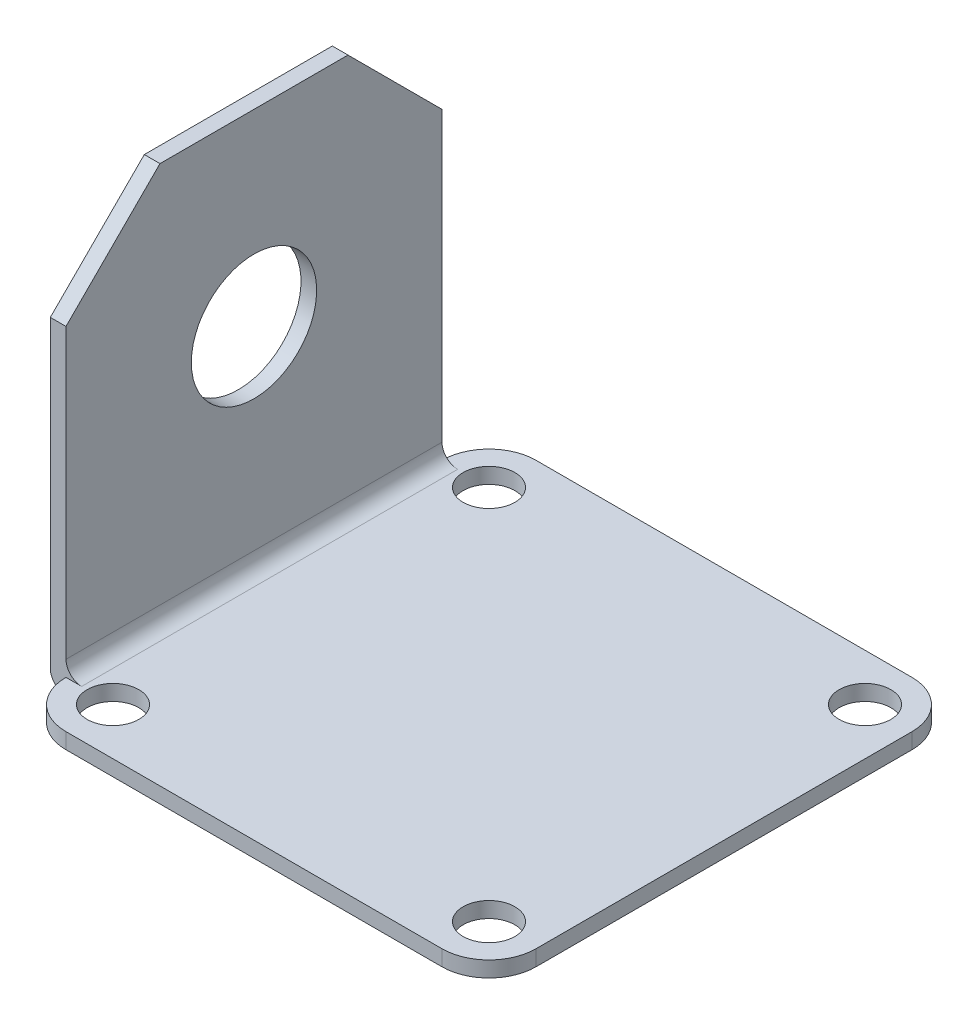
ISO-10303-21;
HEADER;
FILE_DESCRIPTION(('STEP AP214'),'2;1');
FILE_NAME('part.step','',(''),(''),'','','');
FILE_SCHEMA(('AUTOMOTIVE_DESIGN { 1 0 10303 214 1 1 1 1 }'));
ENDSEC;
DATA;
#1=APPLICATION_CONTEXT('core data for automotive mechanical design processes');
#2=APPLICATION_PROTOCOL_DEFINITION('international standard','automotive_design',2000,#1);
#3=PRODUCT_CONTEXT('',#1,'mechanical');
#4=PRODUCT('Part','Part','',(#3));
#5=PRODUCT_RELATED_PRODUCT_CATEGORY('part','',(#4));
#6=PRODUCT_DEFINITION_FORMATION('','',#4);
#7=PRODUCT_DEFINITION_CONTEXT('part definition',#1,'design');
#8=PRODUCT_DEFINITION('design','',#6,#7);
#9=PRODUCT_DEFINITION_SHAPE('','',#8);
#10=(LENGTH_UNIT() NAMED_UNIT(*) SI_UNIT(.MILLI.,.METRE.));
#11=(NAMED_UNIT(*) PLANE_ANGLE_UNIT() SI_UNIT($,.RADIAN.));
#12=(NAMED_UNIT(*) SI_UNIT($,.STERADIAN.) SOLID_ANGLE_UNIT());
#13=UNCERTAINTY_MEASURE_WITH_UNIT(LENGTH_MEASURE(1.E-05),#10,'distance_accuracy_value','');
#14=(GEOMETRIC_REPRESENTATION_CONTEXT(3) GLOBAL_UNCERTAINTY_ASSIGNED_CONTEXT((#13)) GLOBAL_UNIT_ASSIGNED_CONTEXT((#10,
#11,#12)) REPRESENTATION_CONTEXT('',''));
#15=CARTESIAN_POINT('',(0.,0.,0.));
#16=DIRECTION('',(0.,0.,1.));
#17=DIRECTION('',(1.,0.,0.));
#18=AXIS2_PLACEMENT_3D('',#15,#16,#17);
#19=CARTESIAN_POINT('',(3.,26.4,12.));
#20=DIRECTION('',(0.,-1.,0.));
#21=DIRECTION('',(0.,0.,-1.));
#22=AXIS2_PLACEMENT_3D('',#19,#20,#21);
#23=CYLINDRICAL_SURFACE('',#22,3.);
#24=CARTESIAN_POINT('',(3.,1.,12.));
#25=DIRECTION('',(0.,1.,0.));
#26=DIRECTION('',(0.,0.,1.));
#27=AXIS2_PLACEMENT_3D('',#24,#25,#26);
#28=CIRCLE('',#27,3.);
#29=CARTESIAN_POINT('',(0.,1.,12.));
#30=VERTEX_POINT('',#29);
#31=CARTESIAN_POINT('',(3.00000000000002,1.,15.));
#32=VERTEX_POINT('',#31);
#33=EDGE_CURVE('E276',#30,#32,#28,.T.);
#34=ORIENTED_EDGE('',*,*,#33,.F.);
#35=DIRECTION('',(0.,-1.,0.));
#36=VECTOR('',#35,1.);
#37=CARTESIAN_POINT('',(0.,26.4,12.));
#38=LINE('',#37,#36);
#39=CARTESIAN_POINT('',(0.,0.,12.));
#40=VERTEX_POINT('',#39);
#41=EDGE_CURVE('E182',#30,#40,#38,.T.);
#42=ORIENTED_EDGE('',*,*,#41,.T.);
#43=CARTESIAN_POINT('',(3.,0.,12.));
#44=DIRECTION('',(0.,1.,0.));
#45=DIRECTION('',(0.,0.,1.));
#46=AXIS2_PLACEMENT_3D('',#43,#44,#45);
#47=CIRCLE('',#46,3.);
#48=CARTESIAN_POINT('',(3.00000000000002,0.,15.));
#49=VERTEX_POINT('',#48);
#50=EDGE_CURVE('E290',#40,#49,#47,.T.);
#51=ORIENTED_EDGE('',*,*,#50,.T.);
#52=DIRECTION('',(0.,-1.,0.));
#53=VECTOR('',#52,1.);
#54=CARTESIAN_POINT('',(3.00000000000002,26.4,15.));
#55=LINE('',#54,#53);
#56=EDGE_CURVE('E180',#32,#49,#55,.T.);
#57=ORIENTED_EDGE('',*,*,#56,.F.);
#58=EDGE_LOOP('',(#34,#42,#51,#57));
#59=FACE_BOUND('',#58,.T.);
#60=ADVANCED_FACE('F26',(#59),#23,.T.);
#61=CARTESIAN_POINT('',(3.00000000000002,26.4,15.));
#62=DIRECTION('',(0.,0.,-1.));
#63=DIRECTION('',(-1.,0.,0.));
#64=AXIS2_PLACEMENT_3D('',#61,#62,#63);
#65=PLANE('',#64);
#66=DIRECTION('',(1.,0.,0.));
#67=VECTOR('',#66,1.);
#68=CARTESIAN_POINT('',(3.00000000000002,1.,15.));
#69=LINE('',#68,#67);
#70=CARTESIAN_POINT('',(27.,1.,15.));
#71=VERTEX_POINT('',#70);
#72=EDGE_CURVE('E274',#32,#71,#69,.T.);
#73=ORIENTED_EDGE('',*,*,#72,.F.);
#74=ORIENTED_EDGE('',*,*,#56,.T.);
#75=DIRECTION('',(1.,0.,0.));
#76=VECTOR('',#75,1.);
#77=CARTESIAN_POINT('',(3.00000000000002,0.,15.));
#78=LINE('',#77,#76);
#79=CARTESIAN_POINT('',(27.,0.,15.));
#80=VERTEX_POINT('',#79);
#81=EDGE_CURVE('E293',#49,#80,#78,.T.);
#82=ORIENTED_EDGE('',*,*,#81,.T.);
#83=DIRECTION('',(0.,-1.,0.));
#84=VECTOR('',#83,1.);
#85=CARTESIAN_POINT('',(27.,26.4,15.));
#86=LINE('',#85,#84);
#87=EDGE_CURVE('E178',#71,#80,#86,.T.);
#88=ORIENTED_EDGE('',*,*,#87,.F.);
#89=EDGE_LOOP('',(#73,#74,#82,#88));
#90=FACE_BOUND('',#89,.T.);
#91=ADVANCED_FACE('F328',(#90),#65,.F.);
#92=CARTESIAN_POINT('',(27.,26.4,12.));
#93=DIRECTION('',(0.,-1.,0.));
#94=DIRECTION('',(0.,0.,-1.));
#95=AXIS2_PLACEMENT_3D('',#92,#93,#94);
#96=CYLINDRICAL_SURFACE('',#95,3.);
#97=CARTESIAN_POINT('',(27.,1.,12.));
#98=DIRECTION('',(0.,1.,0.));
#99=DIRECTION('',(0.,0.,1.));
#100=AXIS2_PLACEMENT_3D('',#97,#98,#99);
#101=CIRCLE('',#100,3.);
#102=CARTESIAN_POINT('',(30.,1.,12.));
#103=VERTEX_POINT('',#102);
#104=EDGE_CURVE('E272',#71,#103,#101,.T.);
#105=ORIENTED_EDGE('',*,*,#104,.F.);
#106=ORIENTED_EDGE('',*,*,#87,.T.);
#107=CARTESIAN_POINT('',(27.,0.,12.));
#108=DIRECTION('',(0.,1.,0.));
#109=DIRECTION('',(0.,0.,1.));
#110=AXIS2_PLACEMENT_3D('',#107,#108,#109);
#111=CIRCLE('',#110,3.);
#112=CARTESIAN_POINT('',(30.,0.,12.));
#113=VERTEX_POINT('',#112);
#114=EDGE_CURVE('E296',#80,#113,#111,.T.);
#115=ORIENTED_EDGE('',*,*,#114,.T.);
#116=DIRECTION('',(0.,-1.,0.));
#117=VECTOR('',#116,1.);
#118=CARTESIAN_POINT('',(30.,26.4,12.));
#119=LINE('',#118,#117);
#120=EDGE_CURVE('E176',#103,#113,#119,.T.);
#121=ORIENTED_EDGE('',*,*,#120,.F.);
#122=EDGE_LOOP('',(#105,#106,#115,#121));
#123=FACE_BOUND('',#122,.T.);
#124=ADVANCED_FACE('F323',(#123),#96,.T.);
#125=CARTESIAN_POINT('',(30.,26.4,12.));
#126=DIRECTION('',(-1.,0.,0.));
#127=DIRECTION('',(0.,0.,1.));
#128=AXIS2_PLACEMENT_3D('',#125,#126,#127);
#129=PLANE('',#128);
#130=DIRECTION('',(0.,0.,-1.));
#131=VECTOR('',#130,1.);
#132=CARTESIAN_POINT('',(30.,1.,12.));
#133=LINE('',#132,#131);
#134=CARTESIAN_POINT('',(30.,1.,-12.));
#135=VERTEX_POINT('',#134);
#136=EDGE_CURVE('E270',#103,#135,#133,.T.);
#137=ORIENTED_EDGE('',*,*,#136,.F.);
#138=ORIENTED_EDGE('',*,*,#120,.T.);
#139=DIRECTION('',(0.,0.,-1.));
#140=VECTOR('',#139,1.);
#141=CARTESIAN_POINT('',(30.,0.,12.));
#142=LINE('',#141,#140);
#143=CARTESIAN_POINT('',(30.,0.,-12.));
#144=VERTEX_POINT('',#143);
#145=EDGE_CURVE('E299',#113,#144,#142,.T.);
#146=ORIENTED_EDGE('',*,*,#145,.T.);
#147=DIRECTION('',(0.,-1.,0.));
#148=VECTOR('',#147,1.);
#149=CARTESIAN_POINT('',(30.,26.4,-12.));
#150=LINE('',#149,#148);
#151=EDGE_CURVE('E174',#135,#144,#150,.T.);
#152=ORIENTED_EDGE('',*,*,#151,.F.);
#153=EDGE_LOOP('',(#137,#138,#146,#152));
#154=FACE_BOUND('',#153,.T.);
#155=ADVANCED_FACE('F319',(#154),#129,.F.);
#156=CARTESIAN_POINT('',(27.,26.4,-12.));
#157=DIRECTION('',(0.,-1.,0.));
#158=DIRECTION('',(0.,0.,-1.));
#159=AXIS2_PLACEMENT_3D('',#156,#157,#158);
#160=CYLINDRICAL_SURFACE('',#159,3.);
#161=CARTESIAN_POINT('',(27.,1.,-12.));
#162=DIRECTION('',(0.,1.,0.));
#163=DIRECTION('',(0.,0.,1.));
#164=AXIS2_PLACEMENT_3D('',#161,#162,#163);
#165=CIRCLE('',#164,3.);
#166=CARTESIAN_POINT('',(27.,1.,-15.));
#167=VERTEX_POINT('',#166);
#168=EDGE_CURVE('E268',#135,#167,#165,.T.);
#169=ORIENTED_EDGE('',*,*,#168,.F.);
#170=ORIENTED_EDGE('',*,*,#151,.T.);
#171=CARTESIAN_POINT('',(27.,0.,-12.));
#172=DIRECTION('',(0.,1.,0.));
#173=DIRECTION('',(0.,0.,1.));
#174=AXIS2_PLACEMENT_3D('',#171,#172,#173);
#175=CIRCLE('',#174,3.);
#176=CARTESIAN_POINT('',(27.,0.,-15.));
#177=VERTEX_POINT('',#176);
#178=EDGE_CURVE('E302',#144,#177,#175,.T.);
#179=ORIENTED_EDGE('',*,*,#178,.T.);
#180=DIRECTION('',(0.,-1.,0.));
#181=VECTOR('',#180,1.);
#182=CARTESIAN_POINT('',(27.,26.4,-15.));
#183=LINE('',#182,#181);
#184=EDGE_CURVE('E172',#167,#177,#183,.T.);
#185=ORIENTED_EDGE('',*,*,#184,.F.);
#186=EDGE_LOOP('',(#169,#170,#179,#185));
#187=FACE_BOUND('',#186,.T.);
#188=ADVANCED_FACE('F315',(#187),#160,.T.);
#189=CARTESIAN_POINT('',(27.,26.4,-15.));
#190=DIRECTION('',(0.,0.,1.));
#191=DIRECTION('',(1.,0.,0.));
#192=AXIS2_PLACEMENT_3D('',#189,#190,#191);
#193=PLANE('',#192);
#194=DIRECTION('',(-1.,0.,0.));
#195=VECTOR('',#194,1.);
#196=CARTESIAN_POINT('',(27.,1.,-15.));
#197=LINE('',#196,#195);
#198=CARTESIAN_POINT('',(3.00000000000002,1.,-15.));
#199=VERTEX_POINT('',#198);
#200=EDGE_CURVE('E235',#167,#199,#197,.T.);
#201=ORIENTED_EDGE('',*,*,#200,.F.);
#202=ORIENTED_EDGE('',*,*,#184,.T.);
#203=DIRECTION('',(-1.,0.,0.));
#204=VECTOR('',#203,1.);
#205=CARTESIAN_POINT('',(27.,0.,-15.));
#206=LINE('',#205,#204);
#207=CARTESIAN_POINT('',(3.00000000000002,0.,-15.));
#208=VERTEX_POINT('',#207);
#209=EDGE_CURVE('E163',#177,#208,#206,.T.);
#210=ORIENTED_EDGE('',*,*,#209,.T.);
#211=DIRECTION('',(0.,-1.,0.));
#212=VECTOR('',#211,1.);
#213=CARTESIAN_POINT('',(3.00000000000002,26.4,-15.));
#214=LINE('',#213,#212);
#215=EDGE_CURVE('E170',#199,#208,#214,.T.);
#216=ORIENTED_EDGE('',*,*,#215,.F.);
#217=EDGE_LOOP('',(#201,#202,#210,#216));
#218=FACE_BOUND('',#217,.T.);
#219=ADVANCED_FACE('F305',(#218),#193,.F.);
#220=CARTESIAN_POINT('',(3.,26.4,-12.));
#221=DIRECTION('',(0.,-1.,0.));
#222=DIRECTION('',(0.,0.,-1.));
#223=AXIS2_PLACEMENT_3D('',#220,#221,#222);
#224=CYLINDRICAL_SURFACE('',#223,3.);
#225=CARTESIAN_POINT('',(3.,1.,-12.));
#226=DIRECTION('',(0.,1.,0.));
#227=DIRECTION('',(0.,0.,1.));
#228=AXIS2_PLACEMENT_3D('',#225,#226,#227);
#229=CIRCLE('',#228,3.);
#230=CARTESIAN_POINT('',(0.,1.,-12.));
#231=VERTEX_POINT('',#230);
#232=EDGE_CURVE('E232',#199,#231,#229,.T.);
#233=ORIENTED_EDGE('',*,*,#232,.F.);
#234=ORIENTED_EDGE('',*,*,#215,.T.);
#235=CARTESIAN_POINT('',(3.,0.,-12.));
#236=DIRECTION('',(0.,1.,0.));
#237=DIRECTION('',(0.,0.,1.));
#238=AXIS2_PLACEMENT_3D('',#235,#236,#237);
#239=CIRCLE('',#238,3.);
#240=CARTESIAN_POINT('',(0.,0.,-12.));
#241=VERTEX_POINT('',#240);
#242=EDGE_CURVE('E158',#208,#241,#239,.T.);
#243=ORIENTED_EDGE('',*,*,#242,.T.);
#244=DIRECTION('',(0.,-1.,0.));
#245=VECTOR('',#244,1.);
#246=CARTESIAN_POINT('',(0.,26.4,-12.));
#247=LINE('',#246,#245);
#248=EDGE_CURVE('E160',#231,#241,#247,.T.);
#249=ORIENTED_EDGE('',*,*,#248,.F.);
#250=EDGE_LOOP('',(#233,#234,#243,#249));
#251=FACE_BOUND('',#250,.T.);
#252=ADVANCED_FACE('F240',(#251),#224,.T.);
#253=CARTESIAN_POINT('',(27.,26.4,12.));
#254=DIRECTION('',(0.,-1.,0.));
#255=DIRECTION('',(0.,0.,-1.));
#256=AXIS2_PLACEMENT_3D('',#253,#254,#255);
#257=CYLINDRICAL_SURFACE('',#256,1.65);
#258=CARTESIAN_POINT('',(27.,0.,12.));
#259=DIRECTION('',(0.,1.,0.));
#260=DIRECTION('',(0.,0.,1.));
#261=AXIS2_PLACEMENT_3D('',#258,#259,#260);
#262=CIRCLE('',#261,1.65);
#263=CARTESIAN_POINT('',(27.,0.,13.65));
#264=VERTEX_POINT('',#263);
#265=EDGE_CURVE('E287',#264,#264,#262,.T.);
#266=ORIENTED_EDGE('',*,*,#265,.F.);
#267=EDGE_LOOP('',(#266));
#268=FACE_BOUND('',#267,.T.);
#269=CARTESIAN_POINT('',(27.,1.,12.));
#270=DIRECTION('',(0.,1.,0.));
#271=DIRECTION('',(0.,0.,1.));
#272=AXIS2_PLACEMENT_3D('',#269,#270,#271);
#273=CIRCLE('',#272,1.65);
#274=CARTESIAN_POINT('',(27.,1.,13.65));
#275=VERTEX_POINT('',#274);
#276=EDGE_CURVE('E238',#275,#275,#273,.T.);
#277=ORIENTED_EDGE('',*,*,#276,.T.);
#278=EDGE_LOOP('',(#277));
#279=FACE_BOUND('',#278,.T.);
#280=ADVANCED_FACE('F381',(#268,#279),#257,.F.);
#281=CARTESIAN_POINT('',(3.00000000000001,26.4,12.));
#282=DIRECTION('',(0.,-1.,0.));
#283=DIRECTION('',(0.,0.,-1.));
#284=AXIS2_PLACEMENT_3D('',#281,#282,#283);
#285=CYLINDRICAL_SURFACE('',#284,1.65);
#286=CARTESIAN_POINT('',(3.00000000000001,0.,12.));
#287=DIRECTION('',(0.,1.,0.));
#288=DIRECTION('',(0.,0.,-1.));
#289=AXIS2_PLACEMENT_3D('',#286,#287,#288);
#290=CIRCLE('',#289,1.65);
#291=CARTESIAN_POINT('',(3.00000000000001,0.,10.35));
#292=VERTEX_POINT('',#291);
#293=EDGE_CURVE('E284',#292,#292,#290,.T.);
#294=ORIENTED_EDGE('',*,*,#293,.F.);
#295=EDGE_LOOP('',(#294));
#296=FACE_BOUND('',#295,.T.);
#297=CARTESIAN_POINT('',(3.00000000000001,1.,12.));
#298=DIRECTION('',(0.,1.,0.));
#299=DIRECTION('',(0.,0.,1.));
#300=AXIS2_PLACEMENT_3D('',#297,#298,#299);
#301=CIRCLE('',#300,1.65);
#302=CARTESIAN_POINT('',(3.00000000000001,1.,13.65));
#303=VERTEX_POINT('',#302);
#304=EDGE_CURVE('E262',#303,#303,#301,.T.);
#305=ORIENTED_EDGE('',*,*,#304,.T.);
#306=EDGE_LOOP('',(#305));
#307=FACE_BOUND('',#306,.T.);
#308=ADVANCED_FACE('F377',(#296,#307),#285,.F.);
#309=CARTESIAN_POINT('',(3.00000000000001,26.4,-12.));
#310=DIRECTION('',(0.,-1.,0.));
#311=DIRECTION('',(0.,0.,-1.));
#312=AXIS2_PLACEMENT_3D('',#309,#310,#311);
#313=CYLINDRICAL_SURFACE('',#312,1.65);
#314=CARTESIAN_POINT('',(3.00000000000001,0.,-12.));
#315=DIRECTION('',(0.,1.,0.));
#316=DIRECTION('',(0.,0.,1.));
#317=AXIS2_PLACEMENT_3D('',#314,#315,#316);
#318=CIRCLE('',#317,1.65);
#319=CARTESIAN_POINT('',(3.00000000000001,0.,-10.35));
#320=VERTEX_POINT('',#319);
#321=EDGE_CURVE('E281',#320,#320,#318,.T.);
#322=ORIENTED_EDGE('',*,*,#321,.F.);
#323=EDGE_LOOP('',(#322));
#324=FACE_BOUND('',#323,.T.);
#325=CARTESIAN_POINT('',(3.00000000000001,1.,-12.));
#326=DIRECTION('',(0.,1.,0.));
#327=DIRECTION('',(0.,0.,1.));
#328=AXIS2_PLACEMENT_3D('',#325,#326,#327);
#329=CIRCLE('',#328,1.65);
#330=CARTESIAN_POINT('',(3.00000000000001,1.,-10.35));
#331=VERTEX_POINT('',#330);
#332=EDGE_CURVE('E191',#331,#331,#329,.T.);
#333=ORIENTED_EDGE('',*,*,#332,.T.);
#334=EDGE_LOOP('',(#333));
#335=FACE_BOUND('',#334,.T.);
#336=ADVANCED_FACE('F373',(#324,#335),#313,.F.);
#337=CARTESIAN_POINT('',(27.,26.4,-12.));
#338=DIRECTION('',(0.,-1.,0.));
#339=DIRECTION('',(0.,0.,-1.));
#340=AXIS2_PLACEMENT_3D('',#337,#338,#339);
#341=CYLINDRICAL_SURFACE('',#340,1.65);
#342=CARTESIAN_POINT('',(27.,0.,-12.));
#343=DIRECTION('',(0.,1.,0.));
#344=DIRECTION('',(0.,0.,-1.));
#345=AXIS2_PLACEMENT_3D('',#342,#343,#344);
#346=CIRCLE('',#345,1.65);
#347=CARTESIAN_POINT('',(27.,0.,-13.65));
#348=VERTEX_POINT('',#347);
#349=EDGE_CURVE('E278',#348,#348,#346,.T.);
#350=ORIENTED_EDGE('',*,*,#349,.F.);
#351=EDGE_LOOP('',(#350));
#352=FACE_BOUND('',#351,.T.);
#353=CARTESIAN_POINT('',(27.,1.,-12.));
#354=DIRECTION('',(0.,1.,0.));
#355=DIRECTION('',(0.,0.,1.));
#356=AXIS2_PLACEMENT_3D('',#353,#354,#355);
#357=CIRCLE('',#356,1.65);
#358=CARTESIAN_POINT('',(27.,1.,-10.35));
#359=VERTEX_POINT('',#358);
#360=EDGE_CURVE('E188',#359,#359,#357,.T.);
#361=ORIENTED_EDGE('',*,*,#360,.T.);
#362=EDGE_LOOP('',(#361));
#363=FACE_BOUND('',#362,.T.);
#364=ADVANCED_FACE('F370',(#352,#363),#341,.F.);
#365=CARTESIAN_POINT('',(3.,26.4,12.));
#366=DIRECTION('',(0.,1.,0.));
#367=DIRECTION('',(0.,0.,1.));
#368=AXIS2_PLACEMENT_3D('',#365,#366,#367);
#369=PLANE('',#368);
#370=DIRECTION('',(-1.,0.,0.));
#371=VECTOR('',#370,1.);
#372=CARTESIAN_POINT('',(1.00000000000001,26.4,6.));
#373=LINE('',#372,#371);
#374=CARTESIAN_POINT('',(0.,26.4,6.));
#375=VERTEX_POINT('',#374);
#376=CARTESIAN_POINT('',(-0.999999999999994,26.4,6.));
#377=VERTEX_POINT('',#376);
#378=EDGE_CURVE('E132',#375,#377,#373,.T.);
#379=ORIENTED_EDGE('',*,*,#378,.F.);
#380=DIRECTION('',(0.,0.,1.));
#381=VECTOR('',#380,1.);
#382=CARTESIAN_POINT('',(0.,26.4,-16.5358170068647));
#383=LINE('',#382,#381);
#384=CARTESIAN_POINT('',(0.,26.4,-6.));
#385=VERTEX_POINT('',#384);
#386=EDGE_CURVE('E192',#385,#375,#383,.T.);
#387=ORIENTED_EDGE('',*,*,#386,.F.);
#388=DIRECTION('',(-1.,0.,0.));
#389=VECTOR('',#388,1.);
#390=CARTESIAN_POINT('',(1.00000000000001,26.4,-6.));
#391=LINE('',#390,#389);
#392=CARTESIAN_POINT('',(-0.999999999999994,26.4,-6.));
#393=VERTEX_POINT('',#392);
#394=EDGE_CURVE('E156',#385,#393,#391,.T.);
#395=ORIENTED_EDGE('',*,*,#394,.T.);
#396=DIRECTION('',(0.,0.,1.));
#397=VECTOR('',#396,1.);
#398=CARTESIAN_POINT('',(-0.999999999999995,26.4,-12.));
#399=LINE('',#398,#397);
#400=EDGE_CURVE('E149',#393,#377,#399,.T.);
#401=ORIENTED_EDGE('',*,*,#400,.T.);
#402=EDGE_LOOP('',(#379,#387,#395,#401));
#403=FACE_BOUND('',#402,.T.);
#404=ADVANCED_FACE('F155',(#403),#369,.T.);
#405=CARTESIAN_POINT('',(3.,0.,12.));
#406=DIRECTION('',(0.,1.,0.));
#407=DIRECTION('',(0.,0.,1.));
#408=AXIS2_PLACEMENT_3D('',#405,#406,#407);
#409=PLANE('',#408);
#410=ORIENTED_EDGE('',*,*,#321,.T.);
#411=EDGE_LOOP('',(#410));
#412=FACE_BOUND('',#411,.T.);
#413=ORIENTED_EDGE('',*,*,#265,.T.);
#414=EDGE_LOOP('',(#413));
#415=FACE_BOUND('',#414,.T.);
#416=ORIENTED_EDGE('',*,*,#50,.F.);
#417=DIRECTION('',(0.,0.,1.));
#418=VECTOR('',#417,1.);
#419=CARTESIAN_POINT('',(0.,0.,12.));
#420=LINE('',#419,#418);
#421=EDGE_CURVE('E212',#40,#241,#420,.F.);
#422=ORIENTED_EDGE('',*,*,#421,.T.);
#423=ORIENTED_EDGE('',*,*,#242,.F.);
#424=ORIENTED_EDGE('',*,*,#209,.F.);
#425=ORIENTED_EDGE('',*,*,#178,.F.);
#426=ORIENTED_EDGE('',*,*,#145,.F.);
#427=ORIENTED_EDGE('',*,*,#114,.F.);
#428=ORIENTED_EDGE('',*,*,#81,.F.);
#429=EDGE_LOOP('',(#416,#422,#423,#424,#425,#426,#427,#428));
#430=FACE_BOUND('',#429,.T.);
#431=ORIENTED_EDGE('',*,*,#293,.T.);
#432=EDGE_LOOP('',(#431));
#433=FACE_BOUND('',#432,.T.);
#434=ORIENTED_EDGE('',*,*,#349,.T.);
#435=EDGE_LOOP('',(#434));
#436=FACE_BOUND('',#435,.T.);
#437=ADVANCED_FACE('F309',(#412,#415,#430,#433,#436),#409,.F.);
#438=CARTESIAN_POINT('',(-0.999999999999995,26.4,-12.));
#439=DIRECTION('',(1.,0.,0.));
#440=DIRECTION('',(0.,0.,-1.));
#441=AXIS2_PLACEMENT_3D('',#438,#439,#440);
#442=PLANE('',#441);
#443=CARTESIAN_POINT('',(-0.999999999999994,14.4,0.));
#444=DIRECTION('',(-1.,0.,0.));
#445=DIRECTION('',(0.,0.,1.));
#446=AXIS2_PLACEMENT_3D('',#443,#444,#445);
#447=CIRCLE('',#446,4.);
#448=CARTESIAN_POINT('',(-0.999999999999994,14.4,4.));
#449=VERTEX_POINT('',#448);
#450=EDGE_CURVE('E196',#449,#449,#447,.T.);
#451=ORIENTED_EDGE('',*,*,#450,.F.);
#452=EDGE_LOOP('',(#451));
#453=FACE_BOUND('',#452,.T.);
#454=DIRECTION('',(0.,-1.,0.));
#455=VECTOR('',#454,1.);
#456=CARTESIAN_POINT('',(-0.999999999999995,26.4,-12.));
#457=LINE('',#456,#455);
#458=CARTESIAN_POINT('',(-0.999999999999995,20.4,-12.));
#459=VERTEX_POINT('',#458);
#460=CARTESIAN_POINT('',(-0.999999999999995,1.,-12.));
#461=VERTEX_POINT('',#460);
#462=EDGE_CURVE('E157',#459,#461,#457,.T.);
#463=ORIENTED_EDGE('',*,*,#462,.T.);
#464=DIRECTION('',(0.,0.,1.));
#465=VECTOR('',#464,1.);
#466=CARTESIAN_POINT('',(-0.999999999999995,1.,-12.));
#467=LINE('',#466,#465);
#468=CARTESIAN_POINT('',(-0.999999999999993,1.,12.));
#469=VERTEX_POINT('',#468);
#470=EDGE_CURVE('E208',#461,#469,#467,.T.);
#471=ORIENTED_EDGE('',*,*,#470,.T.);
#472=DIRECTION('',(0.,-1.,0.));
#473=VECTOR('',#472,1.);
#474=CARTESIAN_POINT('',(-0.999999999999993,26.4,12.));
#475=LINE('',#474,#473);
#476=CARTESIAN_POINT('',(-0.999999999999993,20.4,12.));
#477=VERTEX_POINT('',#476);
#478=EDGE_CURVE('E152',#477,#469,#475,.T.);
#479=ORIENTED_EDGE('',*,*,#478,.F.);
#480=DIRECTION('',(0.,-0.707106781186547,0.707106781186548));
#481=VECTOR('',#480,1.);
#482=CARTESIAN_POINT('',(-0.999999999999993,20.4,12.));
#483=LINE('',#482,#481);
#484=EDGE_CURVE('E135',#377,#477,#483,.T.);
#485=ORIENTED_EDGE('',*,*,#484,.F.);
#486=ORIENTED_EDGE('',*,*,#400,.F.);
#487=DIRECTION('',(0.,0.707106781186547,0.707106781186548));
#488=VECTOR('',#487,1.);
#489=CARTESIAN_POINT('',(-0.999999999999995,20.4,-12.));
#490=LINE('',#489,#488);
#491=EDGE_CURVE('E250',#459,#393,#490,.T.);
#492=ORIENTED_EDGE('',*,*,#491,.F.);
#493=EDGE_LOOP('',(#463,#471,#479,#485,#486,#492));
#494=FACE_BOUND('',#493,.T.);
#495=ADVANCED_FACE('F28',(#453,#494),#442,.F.);
#496=CARTESIAN_POINT('',(-0.999999999999993,26.4,12.));
#497=DIRECTION('',(0.,0.,-1.));
#498=DIRECTION('',(-1.,0.,0.));
#499=AXIS2_PLACEMENT_3D('',#496,#497,#498);
#500=PLANE('',#499);
#501=ORIENTED_EDGE('',*,*,#478,.T.);
#502=CARTESIAN_POINT('',(0.,1.,12.));
#503=DIRECTION('',(0.,0.,-1.));
#504=DIRECTION('',(-1.,0.,0.));
#505=AXIS2_PLACEMENT_3D('',#502,#503,#504);
#506=CIRCLE('',#505,1.);
#507=EDGE_CURVE('E210',#469,#40,#506,.F.);
#508=ORIENTED_EDGE('',*,*,#507,.T.);
#509=ORIENTED_EDGE('',*,*,#41,.F.);
#510=DIRECTION('',(-1.,0.,0.));
#511=VECTOR('',#510,1.);
#512=CARTESIAN_POINT('',(0.,1.,12.));
#513=LINE('',#512,#511);
#514=CARTESIAN_POINT('',(1.,1.,12.));
#515=VERTEX_POINT('',#514);
#516=EDGE_CURVE('E204',#515,#30,#513,.T.);
#517=ORIENTED_EDGE('',*,*,#516,.F.);
#518=CARTESIAN_POINT('',(1.,2.,12.));
#519=DIRECTION('',(0.,0.,-1.));
#520=DIRECTION('',(-1.,0.,0.));
#521=AXIS2_PLACEMENT_3D('',#518,#519,#520);
#522=CIRCLE('',#521,1.);
#523=CARTESIAN_POINT('',(0.,2.,12.));
#524=VERTEX_POINT('',#523);
#525=EDGE_CURVE('E34',#515,#524,#522,.T.);
#526=ORIENTED_EDGE('',*,*,#525,.T.);
#527=CARTESIAN_POINT('',(0.,20.4,12.));
#528=VERTEX_POINT('',#527);
#529=EDGE_CURVE('E183',#528,#524,#38,.T.);
#530=ORIENTED_EDGE('',*,*,#529,.F.);
#531=DIRECTION('',(-1.,0.,0.));
#532=VECTOR('',#531,1.);
#533=CARTESIAN_POINT('',(1.00000000000001,20.4,12.));
#534=LINE('',#533,#532);
#535=EDGE_CURVE('E143',#528,#477,#534,.T.);
#536=ORIENTED_EDGE('',*,*,#535,.T.);
#537=EDGE_LOOP('',(#501,#508,#509,#517,#526,#530,#536));
#538=FACE_BOUND('',#537,.T.);
#539=ADVANCED_FACE('F217',(#538),#500,.F.);
#540=CARTESIAN_POINT('',(0.,26.4,-12.));
#541=DIRECTION('',(0.,0.,1.));
#542=DIRECTION('',(1.,0.,0.));
#543=AXIS2_PLACEMENT_3D('',#540,#541,#542);
#544=PLANE('',#543);
#545=ORIENTED_EDGE('',*,*,#248,.T.);
#546=CARTESIAN_POINT('',(0.,1.,-12.));
#547=DIRECTION('',(0.,0.,1.));
#548=DIRECTION('',(1.,0.,0.));
#549=AXIS2_PLACEMENT_3D('',#546,#547,#548);
#550=CIRCLE('',#549,1.);
#551=EDGE_CURVE('E46',#241,#461,#550,.F.);
#552=ORIENTED_EDGE('',*,*,#551,.T.);
#553=ORIENTED_EDGE('',*,*,#462,.F.);
#554=DIRECTION('',(-1.,0.,0.));
#555=VECTOR('',#554,1.);
#556=CARTESIAN_POINT('',(1.00000000000001,20.4,-12.));
#557=LINE('',#556,#555);
#558=CARTESIAN_POINT('',(0.,20.4,-12.));
#559=VERTEX_POINT('',#558);
#560=EDGE_CURVE('E252',#559,#459,#557,.T.);
#561=ORIENTED_EDGE('',*,*,#560,.F.);
#562=CARTESIAN_POINT('',(0.,2.,-12.));
#563=VERTEX_POINT('',#562);
#564=EDGE_CURVE('E167',#559,#563,#247,.T.);
#565=ORIENTED_EDGE('',*,*,#564,.T.);
#566=CARTESIAN_POINT('',(1.,2.,-11.9999999999999));
#567=DIRECTION('',(0.,0.,1.));
#568=DIRECTION('',(1.,0.,0.));
#569=AXIS2_PLACEMENT_3D('',#566,#567,#568);
#570=CIRCLE('',#569,1.);
#571=CARTESIAN_POINT('',(1.,1.,-11.9999999999999));
#572=VERTEX_POINT('',#571);
#573=EDGE_CURVE('E11',#563,#572,#570,.T.);
#574=ORIENTED_EDGE('',*,*,#573,.T.);
#575=DIRECTION('',(1.,0.,0.));
#576=VECTOR('',#575,1.);
#577=CARTESIAN_POINT('',(8.81550807393855E-13,1.,-12.));
#578=LINE('',#577,#576);
#579=EDGE_CURVE('E40',#231,#572,#578,.T.);
#580=ORIENTED_EDGE('',*,*,#579,.F.);
#581=EDGE_LOOP('',(#545,#552,#553,#561,#565,#574,#580));
#582=FACE_BOUND('',#581,.T.);
#583=ADVANCED_FACE('F227',(#582),#544,.F.);
#584=CARTESIAN_POINT('',(0.,1.,-16.5358170068647));
#585=DIRECTION('',(-1.,0.,0.));
#586=DIRECTION('',(0.,0.,1.));
#587=AXIS2_PLACEMENT_3D('',#584,#585,#586);
#588=PLANE('',#587);
#589=CARTESIAN_POINT('',(0.,14.4,0.));
#590=DIRECTION('',(-1.,0.,0.));
#591=DIRECTION('',(0.,0.,1.));
#592=AXIS2_PLACEMENT_3D('',#589,#590,#591);
#593=CIRCLE('',#592,4.);
#594=CARTESIAN_POINT('',(0.,14.4,4.));
#595=VERTEX_POINT('',#594);
#596=EDGE_CURVE('E193',#595,#595,#593,.T.);
#597=ORIENTED_EDGE('',*,*,#596,.T.);
#598=EDGE_LOOP('',(#597));
#599=FACE_BOUND('',#598,.T.);
#600=ORIENTED_EDGE('',*,*,#529,.T.);
#601=DIRECTION('',(0.,0.,1.));
#602=VECTOR('',#601,1.);
#603=CARTESIAN_POINT('',(0.,2.,-16.5358170068647));
#604=LINE('',#603,#602);
#605=EDGE_CURVE('E206',#524,#563,#604,.F.);
#606=ORIENTED_EDGE('',*,*,#605,.T.);
#607=ORIENTED_EDGE('',*,*,#564,.F.);
#608=DIRECTION('',(0.,0.707106781186547,0.707106781186548));
#609=VECTOR('',#608,1.);
#610=CARTESIAN_POINT('',(0.,8.43209149656765,-23.9679085034324));
#611=LINE('',#610,#609);
#612=EDGE_CURVE('E187',#559,#385,#611,.T.);
#613=ORIENTED_EDGE('',*,*,#612,.T.);
#614=ORIENTED_EDGE('',*,*,#386,.T.);
#615=DIRECTION('',(0.,-0.707106781186547,0.707106781186548));
#616=VECTOR('',#615,1.);
#617=CARTESIAN_POINT('',(0.,24.9679085034324,7.43209149656764));
#618=LINE('',#617,#616);
#619=EDGE_CURVE('E138',#375,#528,#618,.T.);
#620=ORIENTED_EDGE('',*,*,#619,.T.);
#621=EDGE_LOOP('',(#600,#606,#607,#613,#614,#620));
#622=FACE_BOUND('',#621,.T.);
#623=ADVANCED_FACE('F223',(#599,#622),#588,.F.);
#624=CARTESIAN_POINT('',(0.,1.,16.2321912013306));
#625=DIRECTION('',(0.,1.,0.));
#626=DIRECTION('',(0.,0.,1.));
#627=AXIS2_PLACEMENT_3D('',#624,#625,#626);
#628=PLANE('',#627);
#629=ORIENTED_EDGE('',*,*,#360,.F.);
#630=EDGE_LOOP('',(#629));
#631=FACE_BOUND('',#630,.T.);
#632=ORIENTED_EDGE('',*,*,#332,.F.);
#633=EDGE_LOOP('',(#632));
#634=FACE_BOUND('',#633,.T.);
#635=ORIENTED_EDGE('',*,*,#304,.F.);
#636=EDGE_LOOP('',(#635));
#637=FACE_BOUND('',#636,.T.);
#638=ORIENTED_EDGE('',*,*,#276,.F.);
#639=EDGE_LOOP('',(#638));
#640=FACE_BOUND('',#639,.T.);
#641=DIRECTION('',(0.,0.,1.));
#642=VECTOR('',#641,1.);
#643=CARTESIAN_POINT('',(1.,1.,16.2321912013306));
#644=LINE('',#643,#642);
#645=EDGE_CURVE('E201',#572,#515,#644,.T.);
#646=ORIENTED_EDGE('',*,*,#645,.T.);
#647=ORIENTED_EDGE('',*,*,#516,.T.);
#648=ORIENTED_EDGE('',*,*,#33,.T.);
#649=ORIENTED_EDGE('',*,*,#72,.T.);
#650=ORIENTED_EDGE('',*,*,#104,.T.);
#651=ORIENTED_EDGE('',*,*,#136,.T.);
#652=ORIENTED_EDGE('',*,*,#168,.T.);
#653=ORIENTED_EDGE('',*,*,#200,.T.);
#654=ORIENTED_EDGE('',*,*,#232,.T.);
#655=ORIENTED_EDGE('',*,*,#579,.T.);
#656=EDGE_LOOP('',(#646,#647,#648,#649,#650,#651,#652,#653,#654,#655));
#657=FACE_BOUND('',#656,.T.);
#658=ADVANCED_FACE('F230',(#631,#634,#637,#640,#657),#628,.T.);
#659=CARTESIAN_POINT('',(1.00000000000001,14.4,0.));
#660=DIRECTION('',(-1.,0.,0.));
#661=DIRECTION('',(0.,0.,1.));
#662=AXIS2_PLACEMENT_3D('',#659,#660,#661);
#663=CYLINDRICAL_SURFACE('',#662,4.);
#664=ORIENTED_EDGE('',*,*,#450,.T.);
#665=EDGE_LOOP('',(#664));
#666=FACE_BOUND('',#665,.T.);
#667=ORIENTED_EDGE('',*,*,#596,.F.);
#668=EDGE_LOOP('',(#667));
#669=FACE_BOUND('',#668,.T.);
#670=ADVANCED_FACE('F355',(#666,#669),#663,.F.);
#671=CARTESIAN_POINT('',(1.00000000000001,20.4,-12.));
#672=DIRECTION('',(0.,-0.707106781186548,0.707106781186547));
#673=DIRECTION('',(0.,-0.707106781186547,-0.707106781186548));
#674=AXIS2_PLACEMENT_3D('',#671,#672,#673);
#675=PLANE('',#674);
#676=ORIENTED_EDGE('',*,*,#560,.T.);
#677=ORIENTED_EDGE('',*,*,#491,.T.);
#678=ORIENTED_EDGE('',*,*,#394,.F.);
#679=ORIENTED_EDGE('',*,*,#612,.F.);
#680=EDGE_LOOP('',(#676,#677,#678,#679));
#681=FACE_BOUND('',#680,.T.);
#682=ADVANCED_FACE('F358',(#681),#675,.F.);
#683=CARTESIAN_POINT('',(1.00000000000001,20.4,12.));
#684=DIRECTION('',(0.,-0.707106781186548,-0.707106781186547));
#685=DIRECTION('',(0.,0.707106781186547,-0.707106781186548));
#686=AXIS2_PLACEMENT_3D('',#683,#684,#685);
#687=PLANE('',#686);
#688=ORIENTED_EDGE('',*,*,#378,.T.);
#689=ORIENTED_EDGE('',*,*,#484,.T.);
#690=ORIENTED_EDGE('',*,*,#535,.F.);
#691=ORIENTED_EDGE('',*,*,#619,.F.);
#692=EDGE_LOOP('',(#688,#689,#690,#691));
#693=FACE_BOUND('',#692,.T.);
#694=ADVANCED_FACE('F134',(#693),#687,.F.);
#695=CARTESIAN_POINT('',(1.,2.,16.2321912013306));
#696=DIRECTION('',(0.,0.,1.));
#697=DIRECTION('',(1.,0.,0.));
#698=AXIS2_PLACEMENT_3D('',#695,#696,#697);
#699=CYLINDRICAL_SURFACE('',#698,1.);
#700=ORIENTED_EDGE('',*,*,#573,.F.);
#701=ORIENTED_EDGE('',*,*,#605,.F.);
#702=ORIENTED_EDGE('',*,*,#525,.F.);
#703=ORIENTED_EDGE('',*,*,#645,.F.);
#704=EDGE_LOOP('',(#700,#701,#702,#703));
#705=FACE_BOUND('',#704,.T.);
#706=ADVANCED_FACE('F226',(#705),#699,.F.);
#707=CARTESIAN_POINT('',(0.,1.,-12.));
#708=DIRECTION('',(0.,0.,1.));
#709=DIRECTION('',(1.,0.,0.));
#710=AXIS2_PLACEMENT_3D('',#707,#708,#709);
#711=CYLINDRICAL_SURFACE('',#710,1.);
#712=ORIENTED_EDGE('',*,*,#551,.F.);
#713=ORIENTED_EDGE('',*,*,#421,.F.);
#714=ORIENTED_EDGE('',*,*,#507,.F.);
#715=ORIENTED_EDGE('',*,*,#470,.F.);
#716=EDGE_LOOP('',(#712,#713,#714,#715));
#717=FACE_BOUND('',#716,.T.);
#718=ADVANCED_FACE('F248',(#717),#711,.T.);
#719=CLOSED_SHELL('',(#60,#91,#124,#155,#188,#219,#252,#280,#308,#336,#364,#404,#437,#495,#539,
#583,#623,#658,#670,#682,#694,#706,#718));
#720=MANIFOLD_SOLID_BREP('B2',#719);
#721=ADVANCED_BREP_SHAPE_REPRESENTATION('',(#18,#720),#14);
#722=SHAPE_DEFINITION_REPRESENTATION(#9,#721);
ENDSEC;
END-ISO-10303-21;
